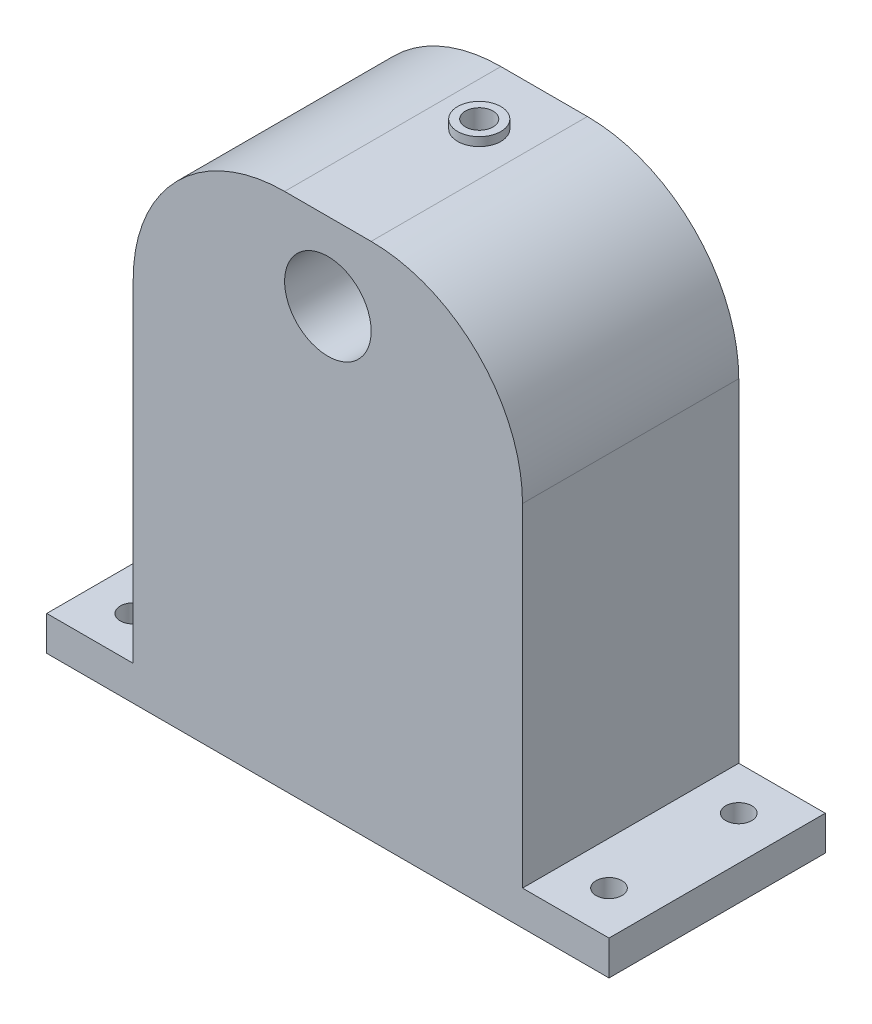
ISO-10303-21;
HEADER;
FILE_DESCRIPTION(('STEP AP214'),'2;1');
FILE_NAME('part.step','',(''),(''),'','','');
FILE_SCHEMA(('AUTOMOTIVE_DESIGN { 1 0 10303 214 1 1 1 1 }'));
ENDSEC;
DATA;
#1=APPLICATION_CONTEXT('core data for automotive mechanical design processes');
#2=APPLICATION_PROTOCOL_DEFINITION('international standard','automotive_design',2000,#1);
#3=PRODUCT_CONTEXT('',#1,'mechanical');
#4=PRODUCT('Part','Part','',(#3));
#5=PRODUCT_RELATED_PRODUCT_CATEGORY('part','',(#4));
#6=PRODUCT_DEFINITION_FORMATION('','',#4);
#7=PRODUCT_DEFINITION_CONTEXT('part definition',#1,'design');
#8=PRODUCT_DEFINITION('design','',#6,#7);
#9=PRODUCT_DEFINITION_SHAPE('','',#8);
#10=(LENGTH_UNIT() NAMED_UNIT(*) SI_UNIT(.MILLI.,.METRE.));
#11=(NAMED_UNIT(*) PLANE_ANGLE_UNIT() SI_UNIT($,.RADIAN.));
#12=(NAMED_UNIT(*) SI_UNIT($,.STERADIAN.) SOLID_ANGLE_UNIT());
#13=UNCERTAINTY_MEASURE_WITH_UNIT(LENGTH_MEASURE(1.E-05),#10,'distance_accuracy_value','');
#14=(GEOMETRIC_REPRESENTATION_CONTEXT(3) GLOBAL_UNCERTAINTY_ASSIGNED_CONTEXT((#13)) GLOBAL_UNIT_ASSIGNED_CONTEXT((#10,
#11,#12)) REPRESENTATION_CONTEXT('',''));
#15=CARTESIAN_POINT('',(0.,0.,0.));
#16=DIRECTION('',(0.,0.,1.));
#17=DIRECTION('',(1.,0.,0.));
#18=AXIS2_PLACEMENT_3D('',#15,#16,#17);
#19=CARTESIAN_POINT('',(0.,60.,0.));
#20=DIRECTION('',(0.,-1.,0.));
#21=DIRECTION('',(0.,0.,-1.));
#22=AXIS2_PLACEMENT_3D('',#19,#20,#21);
#23=PLANE('',#22);
#24=DIRECTION('',(0.,0.,1.));
#25=VECTOR('',#24,1.);
#26=CARTESIAN_POINT('',(5.,60.,-7.50105));
#27=LINE('',#26,#25);
#28=CARTESIAN_POINT('',(5.,60.,-17.5));
#29=VERTEX_POINT('',#28);
#30=CARTESIAN_POINT('',(5.,60.,7.5));
#31=VERTEX_POINT('',#30);
#32=EDGE_CURVE('E231',#29,#31,#27,.T.);
#33=ORIENTED_EDGE('',*,*,#32,.F.);
#34=DIRECTION('',(1.,0.,0.));
#35=VECTOR('',#34,1.);
#36=CARTESIAN_POINT('',(5.,60.,-17.5));
#37=LINE('',#36,#35);
#38=CARTESIAN_POINT('',(-5.00000000000001,60.,-17.5));
#39=VERTEX_POINT('',#38);
#40=EDGE_CURVE('E226',#39,#29,#37,.T.);
#41=ORIENTED_EDGE('',*,*,#40,.F.);
#42=DIRECTION('',(0.,0.,1.));
#43=VECTOR('',#42,1.);
#44=CARTESIAN_POINT('',(-5.,60.,-7.50105));
#45=LINE('',#44,#43);
#46=CARTESIAN_POINT('',(-4.99999999999999,60.,7.5));
#47=VERTEX_POINT('',#46);
#48=EDGE_CURVE('E237',#39,#47,#45,.T.);
#49=ORIENTED_EDGE('',*,*,#48,.T.);
#50=DIRECTION('',(1.,0.,0.));
#51=VECTOR('',#50,1.);
#52=CARTESIAN_POINT('',(22.5,60.,7.5));
#53=LINE('',#52,#51);
#54=EDGE_CURVE('E249',#47,#31,#53,.T.);
#55=ORIENTED_EDGE('',*,*,#54,.T.);
#56=EDGE_LOOP('',(#33,#41,#49,#55));
#57=FACE_BOUND('',#56,.T.);
#58=CARTESIAN_POINT('',(0.,60.,-9.99999999999999));
#59=DIRECTION('',(0.,-1.,0.));
#60=DIRECTION('',(0.,0.,-1.));
#61=AXIS2_PLACEMENT_3D('',#58,#59,#60);
#62=CIRCLE('',#61,2.5);
#63=CARTESIAN_POINT('',(0.,60.,-12.5));
#64=VERTEX_POINT('',#63);
#65=EDGE_CURVE('E11',#64,#64,#62,.F.);
#66=ORIENTED_EDGE('',*,*,#65,.F.);
#67=EDGE_LOOP('',(#66));
#68=FACE_BOUND('',#67,.T.);
#69=ADVANCED_FACE('F33',(#57,#68),#23,.F.);
#70=CARTESIAN_POINT('',(22.5,60.,-7.5));
#71=DIRECTION('',(-1.,0.,0.));
#72=DIRECTION('',(0.,0.,1.));
#73=AXIS2_PLACEMENT_3D('',#70,#71,#72);
#74=PLANE('',#73);
#75=DIRECTION('',(0.,0.,1.));
#76=VECTOR('',#75,1.);
#77=CARTESIAN_POINT('',(22.5,42.5,-7.50105));
#78=LINE('',#77,#76);
#79=CARTESIAN_POINT('',(22.5,42.5,-17.5));
#80=VERTEX_POINT('',#79);
#81=CARTESIAN_POINT('',(22.5,42.5,7.5));
#82=VERTEX_POINT('',#81);
#83=EDGE_CURVE('E230',#80,#82,#78,.T.);
#84=ORIENTED_EDGE('',*,*,#83,.T.);
#85=DIRECTION('',(0.,-1.,0.));
#86=VECTOR('',#85,1.);
#87=CARTESIAN_POINT('',(22.5,60.,7.5));
#88=LINE('',#87,#86);
#89=CARTESIAN_POINT('',(22.5,4.,7.5));
#90=VERTEX_POINT('',#89);
#91=EDGE_CURVE('E252',#82,#90,#88,.T.);
#92=ORIENTED_EDGE('',*,*,#91,.T.);
#93=DIRECTION('',(0.,0.,-1.));
#94=VECTOR('',#93,1.);
#95=CARTESIAN_POINT('',(22.5,4.,-7.5));
#96=LINE('',#95,#94);
#97=CARTESIAN_POINT('',(22.5,4.,-17.5));
#98=VERTEX_POINT('',#97);
#99=EDGE_CURVE('E253',#90,#98,#96,.T.);
#100=ORIENTED_EDGE('',*,*,#99,.T.);
#101=DIRECTION('',(0.,-1.,0.));
#102=VECTOR('',#101,1.);
#103=CARTESIAN_POINT('',(22.5,42.5,-17.5));
#104=LINE('',#103,#102);
#105=EDGE_CURVE('E202',#80,#98,#104,.T.);
#106=ORIENTED_EDGE('',*,*,#105,.F.);
#107=EDGE_LOOP('',(#84,#92,#100,#106));
#108=FACE_BOUND('',#107,.T.);
#109=ADVANCED_FACE('F274',(#108),#74,.F.);
#110=CARTESIAN_POINT('',(0.,4.,0.));
#111=DIRECTION('',(0.,-1.,0.));
#112=DIRECTION('',(0.,0.,-1.));
#113=AXIS2_PLACEMENT_3D('',#110,#111,#112);
#114=PLANE('',#113);
#115=CARTESIAN_POINT('',(27.5,4.,2.5));
#116=DIRECTION('',(0.,1.,0.));
#117=DIRECTION('',(0.,0.,1.));
#118=AXIS2_PLACEMENT_3D('',#115,#116,#117);
#119=CIRCLE('',#118,1.5);
#120=CARTESIAN_POINT('',(27.5,4.,4.));
#121=VERTEX_POINT('',#120);
#122=EDGE_CURVE('E174',#121,#121,#119,.T.);
#123=ORIENTED_EDGE('',*,*,#122,.F.);
#124=EDGE_LOOP('',(#123));
#125=FACE_BOUND('',#124,.T.);
#126=CARTESIAN_POINT('',(27.5,4.,-12.5));
#127=DIRECTION('',(0.,1.,0.));
#128=DIRECTION('',(0.,0.,1.));
#129=AXIS2_PLACEMENT_3D('',#126,#127,#128);
#130=CIRCLE('',#129,1.5);
#131=CARTESIAN_POINT('',(27.5,4.,-11.));
#132=VERTEX_POINT('',#131);
#133=EDGE_CURVE('E182',#132,#132,#130,.T.);
#134=ORIENTED_EDGE('',*,*,#133,.F.);
#135=EDGE_LOOP('',(#134));
#136=FACE_BOUND('',#135,.T.);
#137=ORIENTED_EDGE('',*,*,#99,.F.);
#138=DIRECTION('',(1.,0.,0.));
#139=VECTOR('',#138,1.);
#140=CARTESIAN_POINT('',(32.5,4.,7.5));
#141=LINE('',#140,#139);
#142=CARTESIAN_POINT('',(32.5,4.,7.5));
#143=VERTEX_POINT('',#142);
#144=EDGE_CURVE('E262',#90,#143,#141,.T.);
#145=ORIENTED_EDGE('',*,*,#144,.T.);
#146=DIRECTION('',(0.,0.,-1.));
#147=VECTOR('',#146,1.);
#148=CARTESIAN_POINT('',(32.5,4.,-7.5));
#149=LINE('',#148,#147);
#150=CARTESIAN_POINT('',(32.5,4.,-17.5));
#151=VERTEX_POINT('',#150);
#152=EDGE_CURVE('E289',#143,#151,#149,.T.);
#153=ORIENTED_EDGE('',*,*,#152,.T.);
#154=DIRECTION('',(1.,0.,0.));
#155=VECTOR('',#154,1.);
#156=CARTESIAN_POINT('',(32.5,4.,-17.5));
#157=LINE('',#156,#155);
#158=EDGE_CURVE('E205',#98,#151,#157,.T.);
#159=ORIENTED_EDGE('',*,*,#158,.F.);
#160=EDGE_LOOP('',(#137,#145,#153,#159));
#161=FACE_BOUND('',#160,.T.);
#162=ADVANCED_FACE('F281',(#125,#136,#161),#114,.F.);
#163=CARTESIAN_POINT('',(-27.5,4.,-12.5));
#164=DIRECTION('',(0.,1.,0.));
#165=DIRECTION('',(0.,0.,1.));
#166=AXIS2_PLACEMENT_3D('',#163,#164,#165);
#167=CIRCLE('',#166,1.5);
#168=CARTESIAN_POINT('',(-27.5,4.,-11.));
#169=VERTEX_POINT('',#168);
#170=EDGE_CURVE('E188',#169,#169,#167,.T.);
#171=ORIENTED_EDGE('',*,*,#170,.F.);
#172=EDGE_LOOP('',(#171));
#173=FACE_BOUND('',#172,.T.);
#174=CARTESIAN_POINT('',(-27.5,4.,2.5));
#175=DIRECTION('',(0.,1.,0.));
#176=DIRECTION('',(0.,0.,1.));
#177=AXIS2_PLACEMENT_3D('',#174,#175,#176);
#178=CIRCLE('',#177,1.5);
#179=CARTESIAN_POINT('',(-27.5,4.,4.));
#180=VERTEX_POINT('',#179);
#181=EDGE_CURVE('E194',#180,#180,#178,.T.);
#182=ORIENTED_EDGE('',*,*,#181,.F.);
#183=EDGE_LOOP('',(#182));
#184=FACE_BOUND('',#183,.T.);
#185=DIRECTION('',(0.,0.,1.));
#186=VECTOR('',#185,1.);
#187=CARTESIAN_POINT('',(-22.5,4.,7.5));
#188=LINE('',#187,#186);
#189=CARTESIAN_POINT('',(-22.5,4.,-17.5));
#190=VERTEX_POINT('',#189);
#191=CARTESIAN_POINT('',(-22.5,4.,7.5));
#192=VERTEX_POINT('',#191);
#193=EDGE_CURVE('E246',#190,#192,#188,.T.);
#194=ORIENTED_EDGE('',*,*,#193,.F.);
#195=DIRECTION('',(1.,0.,0.));
#196=VECTOR('',#195,1.);
#197=CARTESIAN_POINT('',(-22.5,4.,-17.5));
#198=LINE('',#197,#196);
#199=CARTESIAN_POINT('',(-32.5,4.,-17.5));
#200=VERTEX_POINT('',#199);
#201=EDGE_CURVE('E217',#200,#190,#198,.T.);
#202=ORIENTED_EDGE('',*,*,#201,.F.);
#203=DIRECTION('',(0.,0.,1.));
#204=VECTOR('',#203,1.);
#205=CARTESIAN_POINT('',(-32.5,4.,7.5));
#206=LINE('',#205,#204);
#207=CARTESIAN_POINT('',(-32.5,4.,7.5));
#208=VERTEX_POINT('',#207);
#209=EDGE_CURVE('E301',#200,#208,#206,.T.);
#210=ORIENTED_EDGE('',*,*,#209,.T.);
#211=EDGE_CURVE('E286',#208,#192,#141,.T.);
#212=ORIENTED_EDGE('',*,*,#211,.T.);
#213=EDGE_LOOP('',(#194,#202,#210,#212));
#214=FACE_BOUND('',#213,.T.);
#215=ADVANCED_FACE('F333',(#173,#184,#214),#114,.F.);
#216=CARTESIAN_POINT('',(32.5,4.,7.5));
#217=DIRECTION('',(0.,0.,-1.));
#218=DIRECTION('',(-1.,0.,0.));
#219=AXIS2_PLACEMENT_3D('',#216,#217,#218);
#220=PLANE('',#219);
#221=CARTESIAN_POINT('',(0.,51.,7.5));
#222=DIRECTION('',(0.,0.,1.));
#223=DIRECTION('',(1.,0.,0.));
#224=AXIS2_PLACEMENT_3D('',#221,#222,#223);
#225=CIRCLE('',#224,5.);
#226=CARTESIAN_POINT('',(5.,51.,7.5));
#227=VERTEX_POINT('',#226);
#228=EDGE_CURVE('E240',#227,#227,#225,.T.);
#229=ORIENTED_EDGE('',*,*,#228,.F.);
#230=EDGE_LOOP('',(#229));
#231=FACE_BOUND('',#230,.T.);
#232=ORIENTED_EDGE('',*,*,#91,.F.);
#233=CARTESIAN_POINT('',(5.,42.5,7.5));
#234=DIRECTION('',(0.,0.,-1.));
#235=DIRECTION('',(1.,0.,0.));
#236=AXIS2_PLACEMENT_3D('',#233,#234,#235);
#237=CIRCLE('',#236,17.5);
#238=EDGE_CURVE('E228',#31,#82,#237,.T.);
#239=ORIENTED_EDGE('',*,*,#238,.F.);
#240=ORIENTED_EDGE('',*,*,#54,.F.);
#241=CARTESIAN_POINT('',(-5.,42.5,7.5));
#242=DIRECTION('',(0.,0.,-1.));
#243=DIRECTION('',(1.,0.,0.));
#244=AXIS2_PLACEMENT_3D('',#241,#242,#243);
#245=CIRCLE('',#244,17.5);
#246=CARTESIAN_POINT('',(-22.5,42.5,7.5));
#247=VERTEX_POINT('',#246);
#248=EDGE_CURVE('E233',#247,#47,#245,.T.);
#249=ORIENTED_EDGE('',*,*,#248,.F.);
#250=DIRECTION('',(0.,-1.,0.));
#251=VECTOR('',#250,1.);
#252=CARTESIAN_POINT('',(-22.5,60.,7.5));
#253=LINE('',#252,#251);
#254=EDGE_CURVE('E268',#247,#192,#253,.T.);
#255=ORIENTED_EDGE('',*,*,#254,.T.);
#256=ORIENTED_EDGE('',*,*,#211,.F.);
#257=DIRECTION('',(0.,-1.,0.));
#258=VECTOR('',#257,1.);
#259=CARTESIAN_POINT('',(-32.5,4.,7.5));
#260=LINE('',#259,#258);
#261=CARTESIAN_POINT('',(-32.5,0.,7.5));
#262=VERTEX_POINT('',#261);
#263=EDGE_CURVE('E299',#208,#262,#260,.T.);
#264=ORIENTED_EDGE('',*,*,#263,.T.);
#265=DIRECTION('',(1.,0.,0.));
#266=VECTOR('',#265,1.);
#267=CARTESIAN_POINT('',(32.5,0.,7.5));
#268=LINE('',#267,#266);
#269=CARTESIAN_POINT('',(32.5,0.,7.5));
#270=VERTEX_POINT('',#269);
#271=EDGE_CURVE('E269',#262,#270,#268,.T.);
#272=ORIENTED_EDGE('',*,*,#271,.T.);
#273=DIRECTION('',(0.,-1.,0.));
#274=VECTOR('',#273,1.);
#275=CARTESIAN_POINT('',(32.5,4.,7.5));
#276=LINE('',#275,#274);
#277=EDGE_CURVE('E41',#143,#270,#276,.T.);
#278=ORIENTED_EDGE('',*,*,#277,.F.);
#279=ORIENTED_EDGE('',*,*,#144,.F.);
#280=EDGE_LOOP('',(#232,#239,#240,#249,#255,#256,#264,#272,#278,#279));
#281=FACE_BOUND('',#280,.T.);
#282=ADVANCED_FACE('F35',(#231,#281),#220,.F.);
#283=CARTESIAN_POINT('',(32.5,4.,-7.5));
#284=DIRECTION('',(-1.,0.,0.));
#285=DIRECTION('',(0.,0.,1.));
#286=AXIS2_PLACEMENT_3D('',#283,#284,#285);
#287=PLANE('',#286);
#288=DIRECTION('',(0.,0.,-1.));
#289=VECTOR('',#288,1.);
#290=CARTESIAN_POINT('',(32.5,0.,-7.5));
#291=LINE('',#290,#289);
#292=CARTESIAN_POINT('',(32.5,0.,-17.5));
#293=VERTEX_POINT('',#292);
#294=EDGE_CURVE('E290',#270,#293,#291,.T.);
#295=ORIENTED_EDGE('',*,*,#294,.T.);
#296=DIRECTION('',(0.,-1.,0.));
#297=VECTOR('',#296,1.);
#298=CARTESIAN_POINT('',(32.5,4.,-17.5));
#299=LINE('',#298,#297);
#300=EDGE_CURVE('E208',#151,#293,#299,.T.);
#301=ORIENTED_EDGE('',*,*,#300,.F.);
#302=ORIENTED_EDGE('',*,*,#152,.F.);
#303=ORIENTED_EDGE('',*,*,#277,.T.);
#304=EDGE_LOOP('',(#295,#301,#302,#303));
#305=FACE_BOUND('',#304,.T.);
#306=ADVANCED_FACE('F313',(#305),#287,.F.);
#307=CARTESIAN_POINT('',(-32.5,4.,7.5));
#308=DIRECTION('',(1.,0.,0.));
#309=DIRECTION('',(0.,0.,-1.));
#310=AXIS2_PLACEMENT_3D('',#307,#308,#309);
#311=PLANE('',#310);
#312=DIRECTION('',(0.,0.,1.));
#313=VECTOR('',#312,1.);
#314=CARTESIAN_POINT('',(-32.5,0.,7.5));
#315=LINE('',#314,#313);
#316=CARTESIAN_POINT('',(-32.5,0.,-17.5));
#317=VERTEX_POINT('',#316);
#318=EDGE_CURVE('E287',#317,#262,#315,.T.);
#319=ORIENTED_EDGE('',*,*,#318,.T.);
#320=ORIENTED_EDGE('',*,*,#263,.F.);
#321=ORIENTED_EDGE('',*,*,#209,.F.);
#322=DIRECTION('',(0.,1.,0.));
#323=VECTOR('',#322,1.);
#324=CARTESIAN_POINT('',(-32.5,4.,-17.5));
#325=LINE('',#324,#323);
#326=EDGE_CURVE('E214',#317,#200,#325,.T.);
#327=ORIENTED_EDGE('',*,*,#326,.F.);
#328=EDGE_LOOP('',(#319,#320,#321,#327));
#329=FACE_BOUND('',#328,.T.);
#330=ADVANCED_FACE('F334',(#329),#311,.F.);
#331=CARTESIAN_POINT('',(0.,0.,0.));
#332=DIRECTION('',(0.,-1.,0.));
#333=DIRECTION('',(0.,0.,-1.));
#334=AXIS2_PLACEMENT_3D('',#331,#332,#333);
#335=PLANE('',#334);
#336=CARTESIAN_POINT('',(27.5,0.,2.5));
#337=DIRECTION('',(0.,-1.,0.));
#338=DIRECTION('',(0.,0.,-1.));
#339=AXIS2_PLACEMENT_3D('',#336,#337,#338);
#340=CIRCLE('',#339,1.5);
#341=CARTESIAN_POINT('',(27.5,0.,1.));
#342=VERTEX_POINT('',#341);
#343=EDGE_CURVE('E178',#342,#342,#340,.F.);
#344=ORIENTED_EDGE('',*,*,#343,.T.);
#345=EDGE_LOOP('',(#344));
#346=FACE_BOUND('',#345,.T.);
#347=CARTESIAN_POINT('',(27.5,0.,-12.5));
#348=DIRECTION('',(0.,-1.,0.));
#349=DIRECTION('',(0.,0.,-1.));
#350=AXIS2_PLACEMENT_3D('',#347,#348,#349);
#351=CIRCLE('',#350,1.5);
#352=CARTESIAN_POINT('',(27.5,0.,-14.));
#353=VERTEX_POINT('',#352);
#354=EDGE_CURVE('E177',#353,#353,#351,.F.);
#355=ORIENTED_EDGE('',*,*,#354,.T.);
#356=EDGE_LOOP('',(#355));
#357=FACE_BOUND('',#356,.T.);
#358=CARTESIAN_POINT('',(-27.5,0.,-12.5));
#359=DIRECTION('',(0.,-1.,0.));
#360=DIRECTION('',(0.,0.,-1.));
#361=AXIS2_PLACEMENT_3D('',#358,#359,#360);
#362=CIRCLE('',#361,1.5);
#363=CARTESIAN_POINT('',(-27.5,0.,-14.));
#364=VERTEX_POINT('',#363);
#365=EDGE_CURVE('E185',#364,#364,#362,.F.);
#366=ORIENTED_EDGE('',*,*,#365,.T.);
#367=EDGE_LOOP('',(#366));
#368=FACE_BOUND('',#367,.T.);
#369=CARTESIAN_POINT('',(-27.5,0.,2.5));
#370=DIRECTION('',(0.,-1.,0.));
#371=DIRECTION('',(0.,0.,-1.));
#372=AXIS2_PLACEMENT_3D('',#369,#370,#371);
#373=CIRCLE('',#372,1.5);
#374=CARTESIAN_POINT('',(-27.5,0.,1.));
#375=VERTEX_POINT('',#374);
#376=EDGE_CURVE('E191',#375,#375,#373,.F.);
#377=ORIENTED_EDGE('',*,*,#376,.T.);
#378=EDGE_LOOP('',(#377));
#379=FACE_BOUND('',#378,.T.);
#380=ORIENTED_EDGE('',*,*,#271,.F.);
#381=ORIENTED_EDGE('',*,*,#318,.F.);
#382=DIRECTION('',(-1.,0.,0.));
#383=VECTOR('',#382,1.);
#384=CARTESIAN_POINT('',(32.5,0.,-17.5));
#385=LINE('',#384,#383);
#386=EDGE_CURVE('E211',#293,#317,#385,.T.);
#387=ORIENTED_EDGE('',*,*,#386,.F.);
#388=ORIENTED_EDGE('',*,*,#294,.F.);
#389=EDGE_LOOP('',(#380,#381,#387,#388));
#390=FACE_BOUND('',#389,.T.);
#391=ADVANCED_FACE('F309',(#346,#357,#368,#379,#390),#335,.T.);
#392=CARTESIAN_POINT('',(-22.5,60.,7.5));
#393=DIRECTION('',(1.,0.,0.));
#394=DIRECTION('',(0.,0.,-1.));
#395=AXIS2_PLACEMENT_3D('',#392,#393,#394);
#396=PLANE('',#395);
#397=ORIENTED_EDGE('',*,*,#254,.F.);
#398=DIRECTION('',(0.,0.,1.));
#399=VECTOR('',#398,1.);
#400=CARTESIAN_POINT('',(-22.5,42.5,-7.50105));
#401=LINE('',#400,#399);
#402=CARTESIAN_POINT('',(-22.5,42.5,-17.5));
#403=VERTEX_POINT('',#402);
#404=EDGE_CURVE('E238',#403,#247,#401,.T.);
#405=ORIENTED_EDGE('',*,*,#404,.F.);
#406=DIRECTION('',(0.,1.,0.));
#407=VECTOR('',#406,1.);
#408=CARTESIAN_POINT('',(-22.5,42.5,-17.5));
#409=LINE('',#408,#407);
#410=EDGE_CURVE('E220',#190,#403,#409,.T.);
#411=ORIENTED_EDGE('',*,*,#410,.F.);
#412=ORIENTED_EDGE('',*,*,#193,.T.);
#413=EDGE_LOOP('',(#397,#405,#411,#412));
#414=FACE_BOUND('',#413,.T.);
#415=ADVANCED_FACE('F331',(#414),#396,.F.);
#416=CARTESIAN_POINT('',(0.,51.,-2.5));
#417=DIRECTION('',(0.,0.,1.));
#418=DIRECTION('',(1.,0.,0.));
#419=AXIS2_PLACEMENT_3D('',#416,#417,#418);
#420=CYLINDRICAL_SURFACE('',#419,5.);
#421=CARTESIAN_POINT('',(0.,51.,-2.5));
#422=DIRECTION('',(0.,0.,1.));
#423=DIRECTION('',(1.,0.,0.));
#424=AXIS2_PLACEMENT_3D('',#421,#422,#423);
#425=CIRCLE('',#424,5.);
#426=CARTESIAN_POINT('',(5.,51.,-2.5));
#427=VERTEX_POINT('',#426);
#428=EDGE_CURVE('E243',#427,#427,#425,.T.);
#429=ORIENTED_EDGE('',*,*,#428,.F.);
#430=EDGE_LOOP('',(#429));
#431=FACE_BOUND('',#430,.T.);
#432=ORIENTED_EDGE('',*,*,#228,.T.);
#433=EDGE_LOOP('',(#432));
#434=FACE_BOUND('',#433,.T.);
#435=ADVANCED_FACE('F350',(#431,#434),#420,.F.);
#436=CARTESIAN_POINT('',(0.,51.,-2.5));
#437=DIRECTION('',(0.,0.,1.));
#438=DIRECTION('',(1.,0.,0.));
#439=AXIS2_PLACEMENT_3D('',#436,#437,#438);
#440=PLANE('',#439);
#441=ORIENTED_EDGE('',*,*,#428,.T.);
#442=EDGE_LOOP('',(#441));
#443=FACE_BOUND('',#442,.T.);
#444=ADVANCED_FACE('F392',(#443),#440,.T.);
#445=CARTESIAN_POINT('',(-5.,42.5,-7.50105));
#446=DIRECTION('',(0.,0.,1.));
#447=DIRECTION('',(1.,0.,0.));
#448=AXIS2_PLACEMENT_3D('',#445,#446,#447);
#449=CYLINDRICAL_SURFACE('',#448,17.5);
#450=ORIENTED_EDGE('',*,*,#48,.F.);
#451=CARTESIAN_POINT('',(-5.,42.5,-17.5));
#452=DIRECTION('',(0.,0.,-1.));
#453=DIRECTION('',(-1.,0.,0.));
#454=AXIS2_PLACEMENT_3D('',#451,#452,#453);
#455=CIRCLE('',#454,17.5);
#456=EDGE_CURVE('E223',#403,#39,#455,.T.);
#457=ORIENTED_EDGE('',*,*,#456,.F.);
#458=ORIENTED_EDGE('',*,*,#404,.T.);
#459=ORIENTED_EDGE('',*,*,#248,.T.);
#460=EDGE_LOOP('',(#450,#457,#458,#459));
#461=FACE_BOUND('',#460,.T.);
#462=ADVANCED_FACE('F326',(#461),#449,.T.);
#463=CARTESIAN_POINT('',(5.,42.5,-7.50105));
#464=DIRECTION('',(0.,0.,1.));
#465=DIRECTION('',(1.,0.,0.));
#466=AXIS2_PLACEMENT_3D('',#463,#464,#465);
#467=CYLINDRICAL_SURFACE('',#466,17.5);
#468=ORIENTED_EDGE('',*,*,#83,.F.);
#469=CARTESIAN_POINT('',(5.,42.5,-17.5));
#470=DIRECTION('',(0.,0.,-1.));
#471=DIRECTION('',(-1.,0.,0.));
#472=AXIS2_PLACEMENT_3D('',#469,#470,#471);
#473=CIRCLE('',#472,17.5);
#474=EDGE_CURVE('E197',#29,#80,#473,.T.);
#475=ORIENTED_EDGE('',*,*,#474,.F.);
#476=ORIENTED_EDGE('',*,*,#32,.T.);
#477=ORIENTED_EDGE('',*,*,#238,.T.);
#478=EDGE_LOOP('',(#468,#475,#476,#477));
#479=FACE_BOUND('',#478,.T.);
#480=ADVANCED_FACE('F319',(#479),#467,.T.);
#481=CARTESIAN_POINT('',(5.,42.5,-17.5));
#482=DIRECTION('',(0.,0.,-1.));
#483=DIRECTION('',(-1.,0.,0.));
#484=AXIS2_PLACEMENT_3D('',#481,#482,#483);
#485=PLANE('',#484);
#486=ORIENTED_EDGE('',*,*,#40,.T.);
#487=ORIENTED_EDGE('',*,*,#474,.T.);
#488=ORIENTED_EDGE('',*,*,#105,.T.);
#489=ORIENTED_EDGE('',*,*,#158,.T.);
#490=ORIENTED_EDGE('',*,*,#300,.T.);
#491=ORIENTED_EDGE('',*,*,#386,.T.);
#492=ORIENTED_EDGE('',*,*,#326,.T.);
#493=ORIENTED_EDGE('',*,*,#201,.T.);
#494=ORIENTED_EDGE('',*,*,#410,.T.);
#495=ORIENTED_EDGE('',*,*,#456,.T.);
#496=EDGE_LOOP('',(#486,#487,#488,#489,#490,#491,#492,#493,#494,#495));
#497=FACE_BOUND('',#496,.T.);
#498=DIRECTION('',(0.,1.,0.));
#499=VECTOR('',#498,1.);
#500=CARTESIAN_POINT('',(2.875,37.5,-17.5));
#501=LINE('',#500,#499);
#502=CARTESIAN_POINT('',(2.875,37.5,-17.5));
#503=VERTEX_POINT('',#502);
#504=CARTESIAN_POINT('',(2.875,40.,-17.5));
#505=VERTEX_POINT('',#504);
#506=EDGE_CURVE('E181',#503,#505,#501,.T.);
#507=ORIENTED_EDGE('',*,*,#506,.T.);
#508=DIRECTION('',(-1.,0.,0.));
#509=VECTOR('',#508,1.);
#510=CARTESIAN_POINT('',(2.875,40.,-17.5));
#511=LINE('',#510,#509);
#512=CARTESIAN_POINT('',(-2.875,40.,-17.5));
#513=VERTEX_POINT('',#512);
#514=EDGE_CURVE('E165',#505,#513,#511,.T.);
#515=ORIENTED_EDGE('',*,*,#514,.T.);
#516=DIRECTION('',(0.,1.,0.));
#517=VECTOR('',#516,1.);
#518=CARTESIAN_POINT('',(-2.875,37.5,-17.5));
#519=LINE('',#518,#517);
#520=CARTESIAN_POINT('',(-2.875,37.5,-17.5));
#521=VERTEX_POINT('',#520);
#522=EDGE_CURVE('E144',#521,#513,#519,.T.);
#523=ORIENTED_EDGE('',*,*,#522,.F.);
#524=DIRECTION('',(-1.,0.,0.));
#525=VECTOR('',#524,1.);
#526=CARTESIAN_POINT('',(-2.875,37.5,-17.5));
#527=LINE('',#526,#525);
#528=EDGE_CURVE('E152',#503,#521,#527,.T.);
#529=ORIENTED_EDGE('',*,*,#528,.F.);
#530=EDGE_LOOP('',(#507,#515,#523,#529));
#531=FACE_BOUND('',#530,.T.);
#532=ADVANCED_FACE('F163',(#497,#531),#485,.T.);
#533=CARTESIAN_POINT('',(-27.5,-0.00100000000000013,2.5));
#534=DIRECTION('',(0.,1.,0.));
#535=DIRECTION('',(0.,0.,1.));
#536=AXIS2_PLACEMENT_3D('',#533,#534,#535);
#537=CYLINDRICAL_SURFACE('',#536,1.5);
#538=ORIENTED_EDGE('',*,*,#376,.F.);
#539=EDGE_LOOP('',(#538));
#540=FACE_BOUND('',#539,.T.);
#541=ORIENTED_EDGE('',*,*,#181,.T.);
#542=EDGE_LOOP('',(#541));
#543=FACE_BOUND('',#542,.T.);
#544=ADVANCED_FACE('F378',(#540,#543),#537,.F.);
#545=CARTESIAN_POINT('',(-27.5,-0.00100000000000013,-12.5));
#546=DIRECTION('',(0.,1.,0.));
#547=DIRECTION('',(0.,0.,1.));
#548=AXIS2_PLACEMENT_3D('',#545,#546,#547);
#549=CYLINDRICAL_SURFACE('',#548,1.5);
#550=ORIENTED_EDGE('',*,*,#365,.F.);
#551=EDGE_LOOP('',(#550));
#552=FACE_BOUND('',#551,.T.);
#553=ORIENTED_EDGE('',*,*,#170,.T.);
#554=EDGE_LOOP('',(#553));
#555=FACE_BOUND('',#554,.T.);
#556=ADVANCED_FACE('F368',(#552,#555),#549,.F.);
#557=CARTESIAN_POINT('',(27.5,-0.00100000000000013,-12.5));
#558=DIRECTION('',(0.,1.,0.));
#559=DIRECTION('',(0.,0.,1.));
#560=AXIS2_PLACEMENT_3D('',#557,#558,#559);
#561=CYLINDRICAL_SURFACE('',#560,1.5);
#562=ORIENTED_EDGE('',*,*,#354,.F.);
#563=EDGE_LOOP('',(#562));
#564=FACE_BOUND('',#563,.T.);
#565=ORIENTED_EDGE('',*,*,#133,.T.);
#566=EDGE_LOOP('',(#565));
#567=FACE_BOUND('',#566,.T.);
#568=ADVANCED_FACE('F365',(#564,#567),#561,.F.);
#569=CARTESIAN_POINT('',(27.5,-0.00100000000000013,2.5));
#570=DIRECTION('',(0.,1.,0.));
#571=DIRECTION('',(0.,0.,1.));
#572=AXIS2_PLACEMENT_3D('',#569,#570,#571);
#573=CYLINDRICAL_SURFACE('',#572,1.5);
#574=ORIENTED_EDGE('',*,*,#343,.F.);
#575=EDGE_LOOP('',(#574));
#576=FACE_BOUND('',#575,.T.);
#577=ORIENTED_EDGE('',*,*,#122,.T.);
#578=EDGE_LOOP('',(#577));
#579=FACE_BOUND('',#578,.T.);
#580=ADVANCED_FACE('F367',(#576,#579),#573,.F.);
#581=CARTESIAN_POINT('',(2.875,37.5,-17.5));
#582=DIRECTION('',(1.,0.,0.));
#583=DIRECTION('',(0.,0.,-1.));
#584=AXIS2_PLACEMENT_3D('',#581,#582,#583);
#585=PLANE('',#584);
#586=DIRECTION('',(0.,1.,0.));
#587=VECTOR('',#586,1.);
#588=CARTESIAN_POINT('',(2.875,37.5,-8.34011797607982));
#589=LINE('',#588,#587);
#590=CARTESIAN_POINT('',(2.875,37.5,-8.34011797607982));
#591=VERTEX_POINT('',#590);
#592=CARTESIAN_POINT('',(2.875,40.,-8.34011797607982));
#593=VERTEX_POINT('',#592);
#594=EDGE_CURVE('E632',#591,#593,#589,.T.);
#595=ORIENTED_EDGE('',*,*,#594,.T.);
#596=DIRECTION('',(0.,0.,-1.));
#597=VECTOR('',#596,1.);
#598=CARTESIAN_POINT('',(2.875,40.,-8.34011797607982));
#599=LINE('',#598,#597);
#600=EDGE_CURVE('E48',#593,#505,#599,.T.);
#601=ORIENTED_EDGE('',*,*,#600,.T.);
#602=ORIENTED_EDGE('',*,*,#506,.F.);
#603=DIRECTION('',(0.,0.,-1.));
#604=VECTOR('',#603,1.);
#605=CARTESIAN_POINT('',(2.875,37.5,-8.34011797607982));
#606=LINE('',#605,#604);
#607=EDGE_CURVE('E159',#591,#503,#606,.T.);
#608=ORIENTED_EDGE('',*,*,#607,.F.);
#609=EDGE_LOOP('',(#595,#601,#602,#608));
#610=FACE_BOUND('',#609,.T.);
#611=ADVANCED_FACE('F375',(#610),#585,.F.);
#612=CARTESIAN_POINT('',(0.,37.5,-6.68023595215965));
#613=DIRECTION('',(0.5,0.,0.866025403784439));
#614=DIRECTION('',(0.866025403784439,0.,-0.5));
#615=AXIS2_PLACEMENT_3D('',#612,#613,#614);
#616=PLANE('',#615);
#617=DIRECTION('',(0.,1.,0.));
#618=VECTOR('',#617,1.);
#619=CARTESIAN_POINT('',(0.,37.5,-6.68023595215965));
#620=LINE('',#619,#618);
#621=CARTESIAN_POINT('',(0.,37.5,-6.68023595215965));
#622=VERTEX_POINT('',#621);
#623=CARTESIAN_POINT('',(0.,40.,-6.68023595215965));
#624=VERTEX_POINT('',#623);
#625=EDGE_CURVE('E168',#622,#624,#620,.T.);
#626=ORIENTED_EDGE('',*,*,#625,.T.);
#627=DIRECTION('',(0.866025403784439,0.,-0.5));
#628=VECTOR('',#627,1.);
#629=CARTESIAN_POINT('',(0.,40.,-6.68023595215965));
#630=LINE('',#629,#628);
#631=EDGE_CURVE('E56',#624,#593,#630,.T.);
#632=ORIENTED_EDGE('',*,*,#631,.T.);
#633=ORIENTED_EDGE('',*,*,#594,.F.);
#634=DIRECTION('',(0.866025403784439,0.,-0.5));
#635=VECTOR('',#634,1.);
#636=CARTESIAN_POINT('',(0.,37.5,-6.68023595215965));
#637=LINE('',#636,#635);
#638=EDGE_CURVE('E170',#622,#591,#637,.T.);
#639=ORIENTED_EDGE('',*,*,#638,.F.);
#640=EDGE_LOOP('',(#626,#632,#633,#639));
#641=FACE_BOUND('',#640,.T.);
#642=ADVANCED_FACE('F500',(#641),#616,.F.);
#643=CARTESIAN_POINT('',(-2.875,37.5,-8.34011797607982));
#644=DIRECTION('',(-0.5,0.,0.866025403784439));
#645=DIRECTION('',(0.866025403784439,0.,0.5));
#646=AXIS2_PLACEMENT_3D('',#643,#644,#645);
#647=PLANE('',#646);
#648=DIRECTION('',(0.,1.,0.));
#649=VECTOR('',#648,1.);
#650=CARTESIAN_POINT('',(-2.875,37.5,-8.34011797607982));
#651=LINE('',#650,#649);
#652=CARTESIAN_POINT('',(-2.875,37.5,-8.34011797607982));
#653=VERTEX_POINT('',#652);
#654=CARTESIAN_POINT('',(-2.875,40.,-8.34011797607982));
#655=VERTEX_POINT('',#654);
#656=EDGE_CURVE('E147',#653,#655,#651,.T.);
#657=ORIENTED_EDGE('',*,*,#656,.T.);
#658=DIRECTION('',(0.866025403784439,0.,0.5));
#659=VECTOR('',#658,1.);
#660=CARTESIAN_POINT('',(0.,40.,-6.68023595215965));
#661=LINE('',#660,#659);
#662=EDGE_CURVE('E623',#655,#624,#661,.T.);
#663=ORIENTED_EDGE('',*,*,#662,.T.);
#664=ORIENTED_EDGE('',*,*,#625,.F.);
#665=DIRECTION('',(0.866025403784439,0.,0.5));
#666=VECTOR('',#665,1.);
#667=CARTESIAN_POINT('',(-2.875,37.5,-8.34011797607982));
#668=LINE('',#667,#666);
#669=EDGE_CURVE('E151',#653,#622,#668,.T.);
#670=ORIENTED_EDGE('',*,*,#669,.F.);
#671=EDGE_LOOP('',(#657,#663,#664,#670));
#672=FACE_BOUND('',#671,.T.);
#673=ADVANCED_FACE('F509',(#672),#647,.F.);
#674=CARTESIAN_POINT('',(-2.875,37.5,-11.6598820239202));
#675=DIRECTION('',(-1.,0.,0.));
#676=DIRECTION('',(0.,0.,1.));
#677=AXIS2_PLACEMENT_3D('',#674,#675,#676);
#678=PLANE('',#677);
#679=ORIENTED_EDGE('',*,*,#522,.T.);
#680=DIRECTION('',(0.,0.,1.));
#681=VECTOR('',#680,1.);
#682=CARTESIAN_POINT('',(-2.875,40.,-8.34011797607982));
#683=LINE('',#682,#681);
#684=EDGE_CURVE('E161',#513,#655,#683,.T.);
#685=ORIENTED_EDGE('',*,*,#684,.T.);
#686=ORIENTED_EDGE('',*,*,#656,.F.);
#687=DIRECTION('',(0.,0.,1.));
#688=VECTOR('',#687,1.);
#689=CARTESIAN_POINT('',(-2.875,37.5,-11.6598820239202));
#690=LINE('',#689,#688);
#691=EDGE_CURVE('E140',#521,#653,#690,.T.);
#692=ORIENTED_EDGE('',*,*,#691,.F.);
#693=EDGE_LOOP('',(#679,#685,#686,#692));
#694=FACE_BOUND('',#693,.T.);
#695=ADVANCED_FACE('F142',(#694),#678,.F.);
#696=CARTESIAN_POINT('',(0.,37.5,0.));
#697=DIRECTION('',(0.,-1.,0.));
#698=DIRECTION('',(0.,0.,-1.));
#699=AXIS2_PLACEMENT_3D('',#696,#697,#698);
#700=PLANE('',#699);
#701=CARTESIAN_POINT('',(0.,37.5,-9.99999999999999));
#702=DIRECTION('',(0.,-1.,0.));
#703=DIRECTION('',(0.,0.,-1.));
#704=AXIS2_PLACEMENT_3D('',#701,#702,#703);
#705=CIRCLE('',#704,1.6);
#706=CARTESIAN_POINT('',(0.,37.5,-11.6));
#707=VERTEX_POINT('',#706);
#708=EDGE_CURVE('E613',#707,#707,#705,.T.);
#709=ORIENTED_EDGE('',*,*,#708,.T.);
#710=EDGE_LOOP('',(#709));
#711=FACE_BOUND('',#710,.T.);
#712=ORIENTED_EDGE('',*,*,#528,.T.);
#713=ORIENTED_EDGE('',*,*,#691,.T.);
#714=ORIENTED_EDGE('',*,*,#669,.T.);
#715=ORIENTED_EDGE('',*,*,#638,.T.);
#716=ORIENTED_EDGE('',*,*,#607,.T.);
#717=EDGE_LOOP('',(#712,#713,#714,#715,#716));
#718=FACE_BOUND('',#717,.T.);
#719=ADVANCED_FACE('F156',(#711,#718),#700,.F.);
#720=CARTESIAN_POINT('',(0.,40.,0.));
#721=DIRECTION('',(0.,-1.,0.));
#722=DIRECTION('',(0.,0.,-1.));
#723=AXIS2_PLACEMENT_3D('',#720,#721,#722);
#724=PLANE('',#723);
#725=CARTESIAN_POINT('',(0.,40.,-9.99999999999999));
#726=DIRECTION('',(0.,1.,0.));
#727=DIRECTION('',(0.,0.,1.));
#728=AXIS2_PLACEMENT_3D('',#725,#726,#727);
#729=CIRCLE('',#728,1.6);
#730=CARTESIAN_POINT('',(0.,40.,-8.4));
#731=VERTEX_POINT('',#730);
#732=EDGE_CURVE('E620',#731,#731,#729,.T.);
#733=ORIENTED_EDGE('',*,*,#732,.T.);
#734=EDGE_LOOP('',(#733));
#735=FACE_BOUND('',#734,.T.);
#736=ORIENTED_EDGE('',*,*,#662,.F.);
#737=ORIENTED_EDGE('',*,*,#684,.F.);
#738=ORIENTED_EDGE('',*,*,#514,.F.);
#739=ORIENTED_EDGE('',*,*,#600,.F.);
#740=ORIENTED_EDGE('',*,*,#631,.F.);
#741=EDGE_LOOP('',(#736,#737,#738,#739,#740));
#742=FACE_BOUND('',#741,.T.);
#743=ADVANCED_FACE('F532',(#735,#742),#724,.T.);
#744=CARTESIAN_POINT('',(0.,40.,-9.99999999999999));
#745=DIRECTION('',(0.,1.,0.));
#746=DIRECTION('',(0.,0.,1.));
#747=AXIS2_PLACEMENT_3D('',#744,#745,#746);
#748=CYLINDRICAL_SURFACE('',#747,1.6);
#749=ORIENTED_EDGE('',*,*,#732,.F.);
#750=EDGE_LOOP('',(#749));
#751=FACE_BOUND('',#750,.T.);
#752=CARTESIAN_POINT('',(0.,61.,-9.99999999999999));
#753=DIRECTION('',(0.,1.,0.));
#754=DIRECTION('',(0.,0.,1.));
#755=AXIS2_PLACEMENT_3D('',#752,#753,#754);
#756=CIRCLE('',#755,1.6);
#757=CARTESIAN_POINT('',(0.,61.,-8.4));
#758=VERTEX_POINT('',#757);
#759=EDGE_CURVE('E610',#758,#758,#756,.T.);
#760=ORIENTED_EDGE('',*,*,#759,.T.);
#761=EDGE_LOOP('',(#760));
#762=FACE_BOUND('',#761,.T.);
#763=ADVANCED_FACE('F536',(#751,#762),#748,.F.);
#764=CARTESIAN_POINT('',(0.,25.,-9.99999999999999));
#765=DIRECTION('',(0.,1.,0.));
#766=DIRECTION('',(0.,0.,1.));
#767=AXIS2_PLACEMENT_3D('',#764,#765,#766);
#768=CYLINDRICAL_SURFACE('',#767,1.6);
#769=CARTESIAN_POINT('',(0.,25.,-9.99999999999999));
#770=DIRECTION('',(0.,1.,0.));
#771=DIRECTION('',(0.,0.,1.));
#772=AXIS2_PLACEMENT_3D('',#769,#770,#771);
#773=CIRCLE('',#772,1.6);
#774=CARTESIAN_POINT('',(0.,25.,-8.4));
#775=VERTEX_POINT('',#774);
#776=EDGE_CURVE('E609',#775,#775,#773,.T.);
#777=ORIENTED_EDGE('',*,*,#776,.F.);
#778=EDGE_LOOP('',(#777));
#779=FACE_BOUND('',#778,.T.);
#780=ORIENTED_EDGE('',*,*,#708,.F.);
#781=EDGE_LOOP('',(#780));
#782=FACE_BOUND('',#781,.T.);
#783=ADVANCED_FACE('F551',(#779,#782),#768,.F.);
#784=CARTESIAN_POINT('',(0.,25.,-9.99999999999999));
#785=DIRECTION('',(0.,1.,0.));
#786=DIRECTION('',(0.,0.,1.));
#787=AXIS2_PLACEMENT_3D('',#784,#785,#786);
#788=PLANE('',#787);
#789=ORIENTED_EDGE('',*,*,#776,.T.);
#790=EDGE_LOOP('',(#789));
#791=FACE_BOUND('',#790,.T.);
#792=ADVANCED_FACE('F556',(#791),#788,.T.);
#793=CARTESIAN_POINT('',(0.,61.,-9.99999999999999));
#794=DIRECTION('',(0.,1.,0.));
#795=DIRECTION('',(0.,0.,1.));
#796=AXIS2_PLACEMENT_3D('',#793,#794,#795);
#797=PLANE('',#796);
#798=CARTESIAN_POINT('',(0.,61.,-9.99999999999999));
#799=DIRECTION('',(0.,1.,0.));
#800=DIRECTION('',(0.,0.,1.));
#801=AXIS2_PLACEMENT_3D('',#798,#799,#800);
#802=CIRCLE('',#801,2.5);
#803=CARTESIAN_POINT('',(0.,61.,-7.49999999999999));
#804=VERTEX_POINT('',#803);
#805=EDGE_CURVE('E607',#804,#804,#802,.T.);
#806=ORIENTED_EDGE('',*,*,#805,.T.);
#807=EDGE_LOOP('',(#806));
#808=FACE_BOUND('',#807,.T.);
#809=ORIENTED_EDGE('',*,*,#759,.F.);
#810=EDGE_LOOP('',(#809));
#811=FACE_BOUND('',#810,.T.);
#812=ADVANCED_FACE('F565',(#808,#811),#797,.T.);
#813=CARTESIAN_POINT('',(0.,61.,-9.99999999999999));
#814=DIRECTION('',(0.,-1.,0.));
#815=DIRECTION('',(0.,0.,-1.));
#816=AXIS2_PLACEMENT_3D('',#813,#814,#815);
#817=CYLINDRICAL_SURFACE('',#816,2.5);
#818=ORIENTED_EDGE('',*,*,#805,.F.);
#819=EDGE_LOOP('',(#818));
#820=FACE_BOUND('',#819,.T.);
#821=ORIENTED_EDGE('',*,*,#65,.T.);
#822=EDGE_LOOP('',(#821));
#823=FACE_BOUND('',#822,.T.);
#824=ADVANCED_FACE('F590',(#820,#823),#817,.T.);
#825=CLOSED_SHELL('',(#69,#109,#162,#215,#282,#306,#330,#391,#415,#435,#444,#462,#480,#532,#544,
#556,#568,#580,#611,#642,#673,#695,#719,#743,#763,#783,#792,#812,#824));
#826=MANIFOLD_SOLID_BREP('B2',#825);
#827=ADVANCED_BREP_SHAPE_REPRESENTATION('',(#18,#826),#14);
#828=SHAPE_DEFINITION_REPRESENTATION(#9,#827);
ENDSEC;
END-ISO-10303-21;
